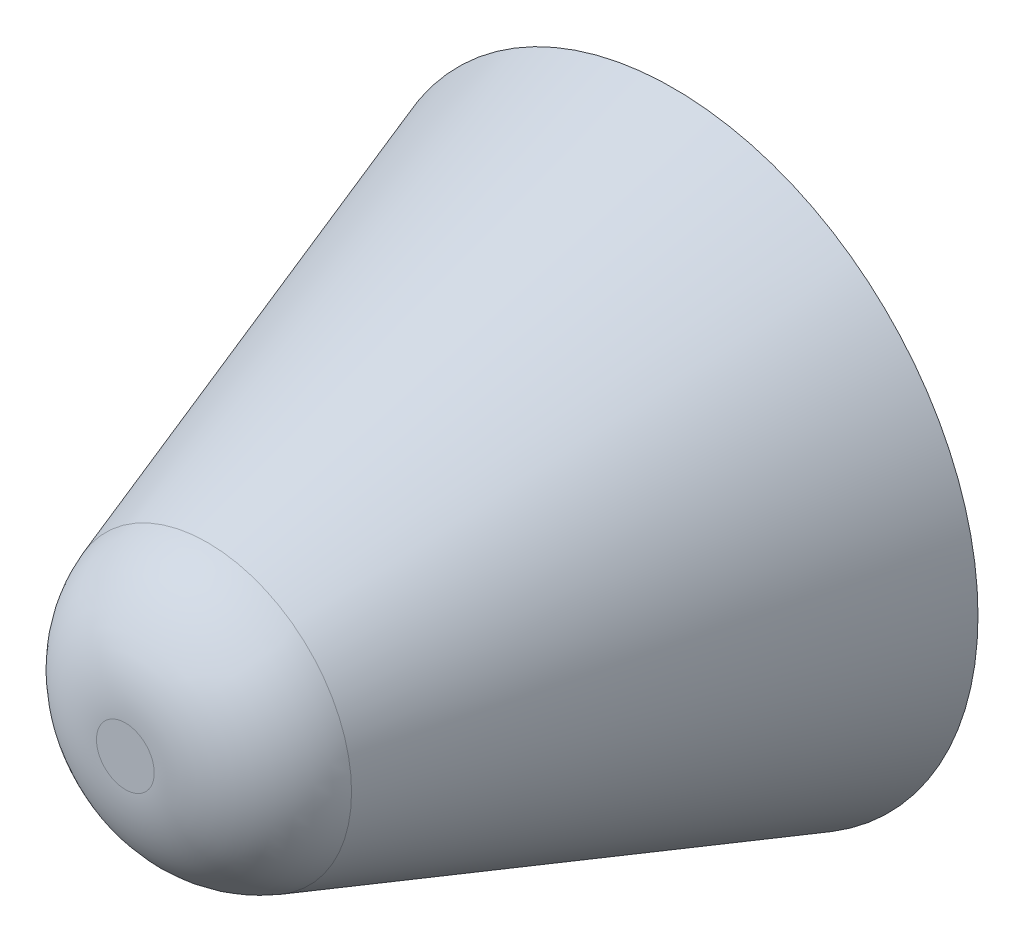
ISO-10303-21;
HEADER;
FILE_DESCRIPTION(('STEP AP214'),'2;1');
FILE_NAME('part.step','',(''),(''),'','','');
FILE_SCHEMA(('AUTOMOTIVE_DESIGN { 1 0 10303 214 1 1 1 1 }'));
ENDSEC;
DATA;
#1=APPLICATION_CONTEXT('core data for automotive mechanical design processes');
#2=APPLICATION_PROTOCOL_DEFINITION('international standard','automotive_design',2000,#1);
#3=PRODUCT_CONTEXT('',#1,'mechanical');
#4=PRODUCT('Part','Part','',(#3));
#5=PRODUCT_RELATED_PRODUCT_CATEGORY('part','',(#4));
#6=PRODUCT_DEFINITION_FORMATION('','',#4);
#7=PRODUCT_DEFINITION_CONTEXT('part definition',#1,'design');
#8=PRODUCT_DEFINITION('design','',#6,#7);
#9=PRODUCT_DEFINITION_SHAPE('','',#8);
#10=(LENGTH_UNIT() NAMED_UNIT(*) SI_UNIT(.MILLI.,.METRE.));
#11=(NAMED_UNIT(*) PLANE_ANGLE_UNIT() SI_UNIT($,.RADIAN.));
#12=(NAMED_UNIT(*) SI_UNIT($,.STERADIAN.) SOLID_ANGLE_UNIT());
#13=UNCERTAINTY_MEASURE_WITH_UNIT(LENGTH_MEASURE(1.E-05),#10,'distance_accuracy_value','');
#14=(GEOMETRIC_REPRESENTATION_CONTEXT(3) GLOBAL_UNCERTAINTY_ASSIGNED_CONTEXT((#13)) GLOBAL_UNIT_ASSIGNED_CONTEXT((#10,
#11,#12)) REPRESENTATION_CONTEXT('',''));
#15=CARTESIAN_POINT('',(0.,0.,0.));
#16=DIRECTION('',(0.,0.,1.));
#17=DIRECTION('',(1.,0.,0.));
#18=AXIS2_PLACEMENT_3D('',#15,#16,#17);
#19=CARTESIAN_POINT('',(0.,0.,0.));
#20=DIRECTION('',(0.,0.,-1.));
#21=DIRECTION('',(1.,0.,0.));
#22=AXIS2_PLACEMENT_3D('',#19,#20,#21);
#23=CONICAL_SURFACE('',#22,0.5,0.331612557878923);
#24=CARTESIAN_POINT('',(0.,0.,0.765113630891431));
#25=DIRECTION('',(0.,0.,-1.));
#26=DIRECTION('',(-1.,0.,0.));
#27=AXIS2_PLACEMENT_3D('',#24,#25,#26);
#28=CIRCLE('',#27,0.236550249579764);
#29=CARTESIAN_POINT('',(-0.236550249579764,0.,0.765113630891431));
#30=VERTEX_POINT('',#29);
#31=EDGE_CURVE('E10',#30,#30,#28,.T.);
#32=ORIENTED_EDGE('',*,*,#31,.T.);
#33=EDGE_LOOP('',(#32));
#34=FACE_BOUND('',#33,.T.);
#35=CARTESIAN_POINT('',(0.,0.,0.));
#36=DIRECTION('',(0.,0.,1.));
#37=DIRECTION('',(1.,0.,0.));
#38=AXIS2_PLACEMENT_3D('',#35,#36,#37);
#39=CIRCLE('',#38,0.5);
#40=CARTESIAN_POINT('',(0.5,0.,0.));
#41=VERTEX_POINT('',#40);
#42=EDGE_CURVE('E42',#41,#41,#39,.T.);
#43=ORIENTED_EDGE('',*,*,#42,.T.);
#44=EDGE_LOOP('',(#43));
#45=FACE_BOUND('',#44,.T.);
#46=ADVANCED_FACE('F31',(#34,#45),#23,.T.);
#47=CARTESIAN_POINT('',(0.,0.,0.9));
#48=DIRECTION('',(0.,0.,1.));
#49=DIRECTION('',(1.,0.,0.));
#50=AXIS2_PLACEMENT_3D('',#47,#48,#49);
#51=PLANE('',#50);
#52=CARTESIAN_POINT('',(0.,0.,0.9));
#53=DIRECTION('',(0.,0.,1.));
#54=DIRECTION('',(1.,0.,0.));
#55=AXIS2_PLACEMENT_3D('',#52,#53,#54);
#56=CIRCLE('',#55,0.0474465344599001);
#57=CARTESIAN_POINT('',(0.0474465344599001,0.,0.9));
#58=VERTEX_POINT('',#57);
#59=EDGE_CURVE('E38',#58,#58,#56,.T.);
#60=ORIENTED_EDGE('',*,*,#59,.T.);
#61=EDGE_LOOP('',(#60));
#62=FACE_BOUND('',#61,.T.);
#63=ADVANCED_FACE('F52',(#62),#51,.T.);
#64=CARTESIAN_POINT('',(0.,0.,0.));
#65=DIRECTION('',(0.,0.,1.));
#66=DIRECTION('',(1.,0.,0.));
#67=AXIS2_PLACEMENT_3D('',#64,#65,#66);
#68=PLANE('',#67);
#69=ORIENTED_EDGE('',*,*,#42,.F.);
#70=EDGE_LOOP('',(#69));
#71=FACE_BOUND('',#70,.T.);
#72=ADVANCED_FACE('F50',(#71),#68,.F.);
#73=CARTESIAN_POINT('',(0.,0.,0.7));
#74=DIRECTION('',(0.,0.,1.));
#75=DIRECTION('',(1.,0.,0.));
#76=AXIS2_PLACEMENT_3D('',#73,#74,#75);
#77=DEGENERATE_TOROIDAL_SURFACE('',#76,0.0474465344599001,0.2,.T.);
#78=ORIENTED_EDGE('',*,*,#31,.F.);
#79=EDGE_LOOP('',(#78));
#80=FACE_BOUND('',#79,.T.);
#81=ORIENTED_EDGE('',*,*,#59,.F.);
#82=EDGE_LOOP('',(#81));
#83=FACE_BOUND('',#82,.T.);
#84=ADVANCED_FACE('F33',(#80,#83),#77,.T.);
#85=CLOSED_SHELL('',(#46,#63,#72,#84));
#86=MANIFOLD_SOLID_BREP('B2',#85);
#87=ADVANCED_BREP_SHAPE_REPRESENTATION('',(#18,#86),#14);
#88=SHAPE_DEFINITION_REPRESENTATION(#9,#87);
ENDSEC;
END-ISO-10303-21;
